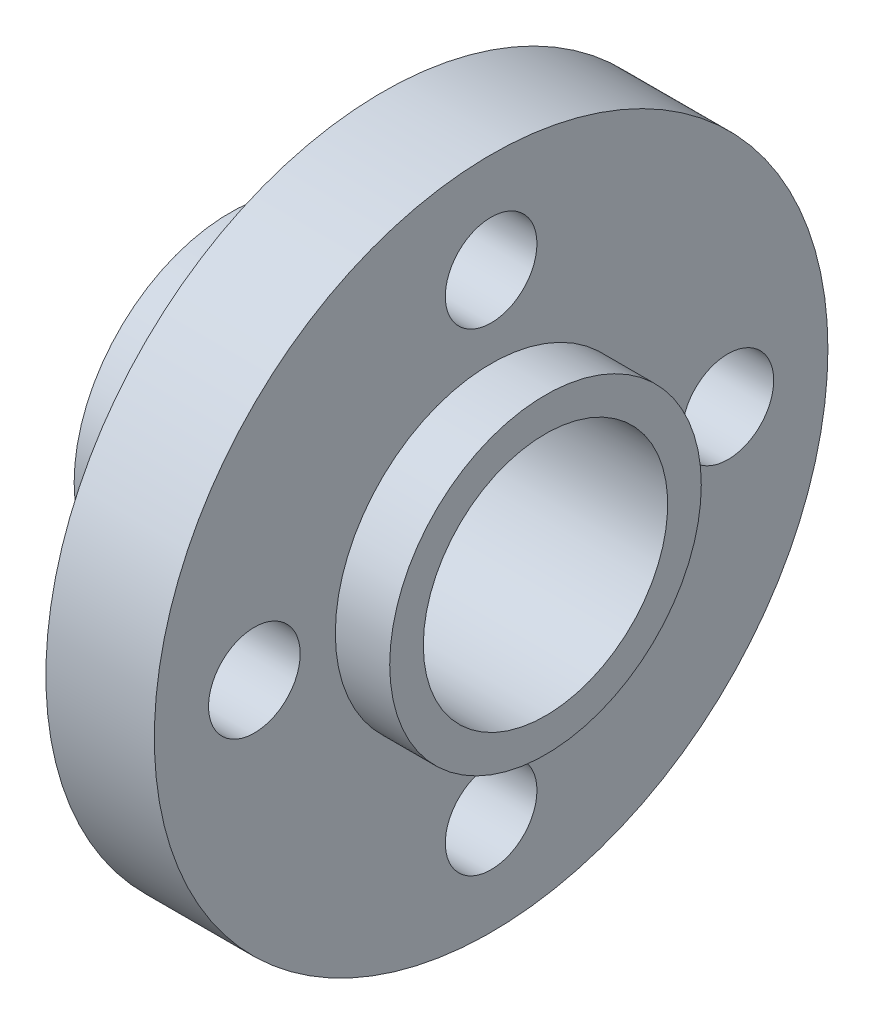
ISO-10303-21;
HEADER;
FILE_DESCRIPTION(('STEP AP214'),'2;1');
FILE_NAME('part.step','',(''),(''),'','','');
FILE_SCHEMA(('AUTOMOTIVE_DESIGN { 1 0 10303 214 1 1 1 1 }'));
ENDSEC;
DATA;
#1=APPLICATION_CONTEXT('core data for automotive mechanical design processes');
#2=APPLICATION_PROTOCOL_DEFINITION('international standard','automotive_design',2000,#1);
#3=PRODUCT_CONTEXT('',#1,'mechanical');
#4=PRODUCT('Part','Part','',(#3));
#5=PRODUCT_RELATED_PRODUCT_CATEGORY('part','',(#4));
#6=PRODUCT_DEFINITION_FORMATION('','',#4);
#7=PRODUCT_DEFINITION_CONTEXT('part definition',#1,'design');
#8=PRODUCT_DEFINITION('design','',#6,#7);
#9=PRODUCT_DEFINITION_SHAPE('','',#8);
#10=(LENGTH_UNIT() NAMED_UNIT(*) SI_UNIT(.MILLI.,.METRE.));
#11=(NAMED_UNIT(*) PLANE_ANGLE_UNIT() SI_UNIT($,.RADIAN.));
#12=(NAMED_UNIT(*) SI_UNIT($,.STERADIAN.) SOLID_ANGLE_UNIT());
#13=UNCERTAINTY_MEASURE_WITH_UNIT(LENGTH_MEASURE(1.E-05),#10,'distance_accuracy_value','');
#14=(GEOMETRIC_REPRESENTATION_CONTEXT(3) GLOBAL_UNCERTAINTY_ASSIGNED_CONTEXT((#13)) GLOBAL_UNIT_ASSIGNED_CONTEXT((#10,
#11,#12)) REPRESENTATION_CONTEXT('',''));
#15=CARTESIAN_POINT('',(0.,0.,0.));
#16=DIRECTION('',(0.,0.,1.));
#17=DIRECTION('',(1.,0.,0.));
#18=AXIS2_PLACEMENT_3D('',#15,#16,#17);
#19=CARTESIAN_POINT('',(3.55,0.,0.));
#20=DIRECTION('',(-1.,0.,0.));
#21=DIRECTION('',(0.,0.,1.));
#22=AXIS2_PLACEMENT_3D('',#19,#20,#21);
#23=CYLINDRICAL_SURFACE('',#22,11.025);
#24=CARTESIAN_POINT('',(3.55,0.,0.));
#25=DIRECTION('',(1.,0.,0.));
#26=DIRECTION('',(0.,0.,-1.));
#27=AXIS2_PLACEMENT_3D('',#24,#25,#26);
#28=CIRCLE('',#27,11.025);
#29=CARTESIAN_POINT('',(3.55,0.,-11.025));
#30=VERTEX_POINT('',#29);
#31=EDGE_CURVE('E50',#30,#30,#28,.T.);
#32=ORIENTED_EDGE('',*,*,#31,.F.);
#33=EDGE_LOOP('',(#32));
#34=FACE_BOUND('',#33,.T.);
#35=CARTESIAN_POINT('',(0.,0.,0.));
#36=DIRECTION('',(1.,0.,0.));
#37=DIRECTION('',(0.,0.,-1.));
#38=AXIS2_PLACEMENT_3D('',#35,#36,#37);
#39=CIRCLE('',#38,11.025);
#40=CARTESIAN_POINT('',(0.,0.,-11.025));
#41=VERTEX_POINT('',#40);
#42=EDGE_CURVE('E54',#41,#41,#39,.T.);
#43=ORIENTED_EDGE('',*,*,#42,.T.);
#44=EDGE_LOOP('',(#43));
#45=FACE_BOUND('',#44,.T.);
#46=ADVANCED_FACE('F44',(#34,#45),#23,.T.);
#47=CARTESIAN_POINT('',(3.55,0.,0.));
#48=DIRECTION('',(1.,0.,0.));
#49=DIRECTION('',(0.,0.,-1.));
#50=AXIS2_PLACEMENT_3D('',#47,#48,#49);
#51=PLANE('',#50);
#52=CARTESIAN_POINT('',(3.55000000000005,0.,7.74999999999998));
#53=DIRECTION('',(1.,0.,0.));
#54=DIRECTION('',(0.,0.,-1.));
#55=AXIS2_PLACEMENT_3D('',#52,#53,#54);
#56=CIRCLE('',#55,1.5);
#57=CARTESIAN_POINT('',(3.55000000000005,0.,6.24999999999998));
#58=VERTEX_POINT('',#57);
#59=EDGE_CURVE('E87',#58,#58,#56,.T.);
#60=ORIENTED_EDGE('',*,*,#59,.F.);
#61=EDGE_LOOP('',(#60));
#62=FACE_BOUND('',#61,.T.);
#63=CARTESIAN_POINT('',(3.55,7.75,-1.11022302462516E-13));
#64=DIRECTION('',(1.,0.,0.));
#65=DIRECTION('',(0.,0.,-1.));
#66=AXIS2_PLACEMENT_3D('',#63,#64,#65);
#67=CIRCLE('',#66,1.5);
#68=CARTESIAN_POINT('',(3.55,7.75,-1.50000000000011));
#69=VERTEX_POINT('',#68);
#70=EDGE_CURVE('E90',#69,#69,#67,.T.);
#71=ORIENTED_EDGE('',*,*,#70,.F.);
#72=EDGE_LOOP('',(#71));
#73=FACE_BOUND('',#72,.T.);
#74=CARTESIAN_POINT('',(3.55,-7.75,0.));
#75=DIRECTION('',(1.,0.,0.));
#76=DIRECTION('',(0.,0.,-1.));
#77=AXIS2_PLACEMENT_3D('',#74,#75,#76);
#78=CIRCLE('',#77,1.5);
#79=CARTESIAN_POINT('',(3.55,-7.75,-1.5));
#80=VERTEX_POINT('',#79);
#81=EDGE_CURVE('E81',#80,#80,#78,.T.);
#82=ORIENTED_EDGE('',*,*,#81,.F.);
#83=EDGE_LOOP('',(#82));
#84=FACE_BOUND('',#83,.T.);
#85=CARTESIAN_POINT('',(3.55000000000005,0.,-7.75000000000001));
#86=DIRECTION('',(1.,0.,0.));
#87=DIRECTION('',(0.,0.,-1.));
#88=AXIS2_PLACEMENT_3D('',#85,#86,#87);
#89=CIRCLE('',#88,1.5);
#90=CARTESIAN_POINT('',(3.55000000000005,0.,-9.25000000000001));
#91=VERTEX_POINT('',#90);
#92=EDGE_CURVE('E73',#91,#91,#89,.T.);
#93=ORIENTED_EDGE('',*,*,#92,.F.);
#94=EDGE_LOOP('',(#93));
#95=FACE_BOUND('',#94,.T.);
#96=CARTESIAN_POINT('',(3.55,0.,0.));
#97=DIRECTION('',(1.,0.,0.));
#98=DIRECTION('',(0.,0.,-1.));
#99=AXIS2_PLACEMENT_3D('',#96,#97,#98);
#100=CIRCLE('',#99,5.1);
#101=CARTESIAN_POINT('',(3.55,0.,-5.10000000000003));
#102=VERTEX_POINT('',#101);
#103=EDGE_CURVE('E61',#102,#102,#100,.T.);
#104=ORIENTED_EDGE('',*,*,#103,.F.);
#105=EDGE_LOOP('',(#104));
#106=FACE_BOUND('',#105,.T.);
#107=ORIENTED_EDGE('',*,*,#31,.T.);
#108=EDGE_LOOP('',(#107));
#109=FACE_BOUND('',#108,.T.);
#110=ADVANCED_FACE('F106',(#62,#73,#84,#95,#106,#109),#51,.T.);
#111=CARTESIAN_POINT('',(0.,0.,0.));
#112=DIRECTION('',(1.,0.,0.));
#113=DIRECTION('',(0.,0.,-1.));
#114=AXIS2_PLACEMENT_3D('',#111,#112,#113);
#115=PLANE('',#114);
#116=CARTESIAN_POINT('',(0.,0.,7.75000000000001));
#117=DIRECTION('',(-1.,0.,0.));
#118=DIRECTION('',(0.,0.,-1.));
#119=AXIS2_PLACEMENT_3D('',#116,#117,#118);
#120=CIRCLE('',#119,1.5);
#121=CARTESIAN_POINT('',(0.,0.,6.25000000000001));
#122=VERTEX_POINT('',#121);
#123=EDGE_CURVE('E93',#122,#122,#120,.T.);
#124=ORIENTED_EDGE('',*,*,#123,.F.);
#125=EDGE_LOOP('',(#124));
#126=FACE_BOUND('',#125,.T.);
#127=CARTESIAN_POINT('',(0.,7.75,0.));
#128=DIRECTION('',(-1.,0.,0.));
#129=DIRECTION('',(0.,-1.,0.));
#130=AXIS2_PLACEMENT_3D('',#127,#128,#129);
#131=CIRCLE('',#130,1.5);
#132=CARTESIAN_POINT('',(0.,6.25,0.));
#133=VERTEX_POINT('',#132);
#134=EDGE_CURVE('E94',#133,#133,#131,.T.);
#135=ORIENTED_EDGE('',*,*,#134,.F.);
#136=EDGE_LOOP('',(#135));
#137=FACE_BOUND('',#136,.T.);
#138=CARTESIAN_POINT('',(0.,-7.75,0.));
#139=DIRECTION('',(-1.,0.,0.));
#140=DIRECTION('',(0.,1.,0.));
#141=AXIS2_PLACEMENT_3D('',#138,#139,#140);
#142=CIRCLE('',#141,1.5);
#143=CARTESIAN_POINT('',(0.,-6.25,0.));
#144=VERTEX_POINT('',#143);
#145=EDGE_CURVE('E84',#144,#144,#142,.T.);
#146=ORIENTED_EDGE('',*,*,#145,.F.);
#147=EDGE_LOOP('',(#146));
#148=FACE_BOUND('',#147,.T.);
#149=CARTESIAN_POINT('',(0.,0.,-7.75000000000001));
#150=DIRECTION('',(-1.,0.,0.));
#151=DIRECTION('',(0.,0.,1.));
#152=AXIS2_PLACEMENT_3D('',#149,#150,#151);
#153=CIRCLE('',#152,1.5);
#154=CARTESIAN_POINT('',(0.,0.,-6.25000000000001));
#155=VERTEX_POINT('',#154);
#156=EDGE_CURVE('E78',#155,#155,#153,.T.);
#157=ORIENTED_EDGE('',*,*,#156,.F.);
#158=EDGE_LOOP('',(#157));
#159=FACE_BOUND('',#158,.T.);
#160=CARTESIAN_POINT('',(0.,0.,0.));
#161=DIRECTION('',(1.,0.,0.));
#162=DIRECTION('',(0.,0.,-1.));
#163=AXIS2_PLACEMENT_3D('',#160,#161,#162);
#164=CIRCLE('',#163,5.1);
#165=CARTESIAN_POINT('',(0.,0.,-5.1));
#166=VERTEX_POINT('',#165);
#167=EDGE_CURVE('E12',#166,#166,#164,.F.);
#168=ORIENTED_EDGE('',*,*,#167,.F.);
#169=EDGE_LOOP('',(#168));
#170=FACE_BOUND('',#169,.T.);
#171=ORIENTED_EDGE('',*,*,#42,.F.);
#172=EDGE_LOOP('',(#171));
#173=FACE_BOUND('',#172,.T.);
#174=ADVANCED_FACE('F102',(#126,#137,#148,#159,#170,#173),#115,.F.);
#175=CARTESIAN_POINT('',(5.33,0.,0.));
#176=DIRECTION('',(-1.,0.,0.));
#177=DIRECTION('',(0.,0.,1.));
#178=AXIS2_PLACEMENT_3D('',#175,#176,#177);
#179=CYLINDRICAL_SURFACE('',#178,5.1);
#180=CARTESIAN_POINT('',(5.33,0.,0.));
#181=DIRECTION('',(1.,0.,0.));
#182=DIRECTION('',(0.,0.,-1.));
#183=AXIS2_PLACEMENT_3D('',#180,#181,#182);
#184=CIRCLE('',#183,5.1);
#185=CARTESIAN_POINT('',(5.33,0.,-5.1));
#186=VERTEX_POINT('',#185);
#187=EDGE_CURVE('E59',#186,#186,#184,.T.);
#188=ORIENTED_EDGE('',*,*,#187,.F.);
#189=EDGE_LOOP('',(#188));
#190=FACE_BOUND('',#189,.T.);
#191=ORIENTED_EDGE('',*,*,#103,.T.);
#192=EDGE_LOOP('',(#191));
#193=FACE_BOUND('',#192,.T.);
#194=ADVANCED_FACE('F105',(#190,#193),#179,.T.);
#195=CARTESIAN_POINT('',(5.33,0.,0.));
#196=DIRECTION('',(1.,0.,0.));
#197=DIRECTION('',(0.,0.,-1.));
#198=AXIS2_PLACEMENT_3D('',#195,#196,#197);
#199=PLANE('',#198);
#200=CARTESIAN_POINT('',(5.33,0.,0.));
#201=DIRECTION('',(-1.,0.,0.));
#202=DIRECTION('',(0.,0.,1.));
#203=AXIS2_PLACEMENT_3D('',#200,#201,#202);
#204=CIRCLE('',#203,4.);
#205=CARTESIAN_POINT('',(5.33,0.,4.));
#206=VERTEX_POINT('',#205);
#207=EDGE_CURVE('E69',#206,#206,#204,.T.);
#208=ORIENTED_EDGE('',*,*,#207,.T.);
#209=EDGE_LOOP('',(#208));
#210=FACE_BOUND('',#209,.T.);
#211=ORIENTED_EDGE('',*,*,#187,.T.);
#212=EDGE_LOOP('',(#211));
#213=FACE_BOUND('',#212,.T.);
#214=ADVANCED_FACE('F130',(#210,#213),#199,.T.);
#215=CARTESIAN_POINT('',(-5.,0.,0.));
#216=DIRECTION('',(1.,0.,0.));
#217=DIRECTION('',(0.,0.,-1.));
#218=AXIS2_PLACEMENT_3D('',#215,#216,#217);
#219=CYLINDRICAL_SURFACE('',#218,5.1);
#220=CARTESIAN_POINT('',(-5.,0.,0.));
#221=DIRECTION('',(-1.,0.,0.));
#222=DIRECTION('',(0.,0.,1.));
#223=AXIS2_PLACEMENT_3D('',#220,#221,#222);
#224=CIRCLE('',#223,5.1);
#225=CARTESIAN_POINT('',(-5.,0.,5.09999999999997));
#226=VERTEX_POINT('',#225);
#227=EDGE_CURVE('E64',#226,#226,#224,.T.);
#228=ORIENTED_EDGE('',*,*,#227,.F.);
#229=EDGE_LOOP('',(#228));
#230=FACE_BOUND('',#229,.T.);
#231=ORIENTED_EDGE('',*,*,#167,.T.);
#232=EDGE_LOOP('',(#231));
#233=FACE_BOUND('',#232,.T.);
#234=ADVANCED_FACE('F134',(#230,#233),#219,.T.);
#235=CARTESIAN_POINT('',(-5.,0.,0.));
#236=DIRECTION('',(-1.,0.,0.));
#237=DIRECTION('',(0.,0.,1.));
#238=AXIS2_PLACEMENT_3D('',#235,#236,#237);
#239=PLANE('',#238);
#240=CARTESIAN_POINT('',(-5.,0.,0.));
#241=DIRECTION('',(-1.,0.,0.));
#242=DIRECTION('',(0.,0.,1.));
#243=AXIS2_PLACEMENT_3D('',#240,#241,#242);
#244=CIRCLE('',#243,4.);
#245=CARTESIAN_POINT('',(-5.,0.,3.99999999999997));
#246=VERTEX_POINT('',#245);
#247=EDGE_CURVE('E70',#246,#246,#244,.T.);
#248=ORIENTED_EDGE('',*,*,#247,.F.);
#249=EDGE_LOOP('',(#248));
#250=FACE_BOUND('',#249,.T.);
#251=ORIENTED_EDGE('',*,*,#227,.T.);
#252=EDGE_LOOP('',(#251));
#253=FACE_BOUND('',#252,.T.);
#254=ADVANCED_FACE('F138',(#250,#253),#239,.T.);
#255=CARTESIAN_POINT('',(5.33,0.,0.));
#256=DIRECTION('',(-1.,0.,0.));
#257=DIRECTION('',(0.,0.,1.));
#258=AXIS2_PLACEMENT_3D('',#255,#256,#257);
#259=CYLINDRICAL_SURFACE('',#258,4.);
#260=ORIENTED_EDGE('',*,*,#207,.F.);
#261=EDGE_LOOP('',(#260));
#262=FACE_BOUND('',#261,.T.);
#263=ORIENTED_EDGE('',*,*,#247,.T.);
#264=EDGE_LOOP('',(#263));
#265=FACE_BOUND('',#264,.T.);
#266=ADVANCED_FACE('F142',(#262,#265),#259,.F.);
#267=CARTESIAN_POINT('',(5.33,0.,-7.75000000000001));
#268=DIRECTION('',(-1.,0.,0.));
#269=DIRECTION('',(0.,0.,1.));
#270=AXIS2_PLACEMENT_3D('',#267,#268,#269);
#271=CYLINDRICAL_SURFACE('',#270,1.5);
#272=ORIENTED_EDGE('',*,*,#92,.T.);
#273=EDGE_LOOP('',(#272));
#274=FACE_BOUND('',#273,.T.);
#275=ORIENTED_EDGE('',*,*,#156,.T.);
#276=EDGE_LOOP('',(#275));
#277=FACE_BOUND('',#276,.T.);
#278=ADVANCED_FACE('F146',(#274,#277),#271,.F.);
#279=CARTESIAN_POINT('',(5.33,-7.75,0.));
#280=DIRECTION('',(-1.,0.,0.));
#281=DIRECTION('',(0.,0.,1.));
#282=AXIS2_PLACEMENT_3D('',#279,#280,#281);
#283=CYLINDRICAL_SURFACE('',#282,1.5);
#284=ORIENTED_EDGE('',*,*,#81,.T.);
#285=EDGE_LOOP('',(#284));
#286=FACE_BOUND('',#285,.T.);
#287=ORIENTED_EDGE('',*,*,#145,.T.);
#288=EDGE_LOOP('',(#287));
#289=FACE_BOUND('',#288,.T.);
#290=ADVANCED_FACE('F150',(#286,#289),#283,.F.);
#291=CARTESIAN_POINT('',(5.33,7.75,0.));
#292=DIRECTION('',(-1.,0.,0.));
#293=DIRECTION('',(0.,0.,1.));
#294=AXIS2_PLACEMENT_3D('',#291,#292,#293);
#295=CYLINDRICAL_SURFACE('',#294,1.5);
#296=ORIENTED_EDGE('',*,*,#70,.T.);
#297=EDGE_LOOP('',(#296));
#298=FACE_BOUND('',#297,.T.);
#299=ORIENTED_EDGE('',*,*,#134,.T.);
#300=EDGE_LOOP('',(#299));
#301=FACE_BOUND('',#300,.T.);
#302=ADVANCED_FACE('F154',(#298,#301),#295,.F.);
#303=CARTESIAN_POINT('',(5.33000000000006,0.,7.74999999999998));
#304=DIRECTION('',(-1.,0.,0.));
#305=DIRECTION('',(0.,0.,1.));
#306=AXIS2_PLACEMENT_3D('',#303,#304,#305);
#307=CYLINDRICAL_SURFACE('',#306,1.5);
#308=ORIENTED_EDGE('',*,*,#59,.T.);
#309=EDGE_LOOP('',(#308));
#310=FACE_BOUND('',#309,.T.);
#311=ORIENTED_EDGE('',*,*,#123,.T.);
#312=EDGE_LOOP('',(#311));
#313=FACE_BOUND('',#312,.T.);
#314=ADVANCED_FACE('F100',(#310,#313),#307,.F.);
#315=CLOSED_SHELL('',(#46,#110,#174,#194,#214,#234,#254,#266,#278,#290,#302,#314));
#316=MANIFOLD_SOLID_BREP('B2',#315);
#317=ADVANCED_BREP_SHAPE_REPRESENTATION('',(#18,#316),#14);
#318=SHAPE_DEFINITION_REPRESENTATION(#9,#317);
ENDSEC;
END-ISO-10303-21;
